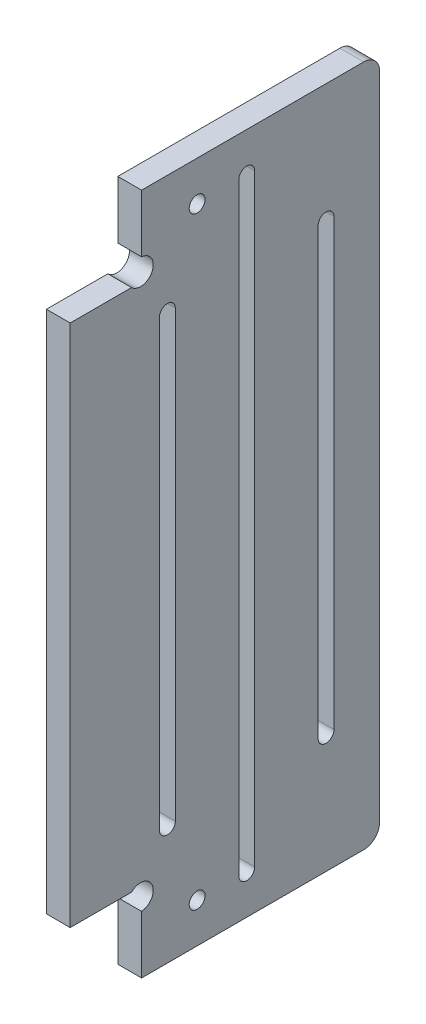
ISO-10303-21;
HEADER;
FILE_DESCRIPTION(('STEP AP214'),'2;1');
FILE_NAME('part.step','',(''),(''),'','','');
FILE_SCHEMA(('AUTOMOTIVE_DESIGN { 1 0 10303 214 1 1 1 1 }'));
ENDSEC;
DATA;
#1=APPLICATION_CONTEXT('core data for automotive mechanical design processes');
#2=APPLICATION_PROTOCOL_DEFINITION('international standard','automotive_design',2000,#1);
#3=PRODUCT_CONTEXT('',#1,'mechanical');
#4=PRODUCT('Part','Part','',(#3));
#5=PRODUCT_RELATED_PRODUCT_CATEGORY('part','',(#4));
#6=PRODUCT_DEFINITION_FORMATION('','',#4);
#7=PRODUCT_DEFINITION_CONTEXT('part definition',#1,'design');
#8=PRODUCT_DEFINITION('design','',#6,#7);
#9=PRODUCT_DEFINITION_SHAPE('','',#8);
#10=(LENGTH_UNIT() NAMED_UNIT(*) SI_UNIT(.MILLI.,.METRE.));
#11=(NAMED_UNIT(*) PLANE_ANGLE_UNIT() SI_UNIT($,.RADIAN.));
#12=(NAMED_UNIT(*) SI_UNIT($,.STERADIAN.) SOLID_ANGLE_UNIT());
#13=UNCERTAINTY_MEASURE_WITH_UNIT(LENGTH_MEASURE(1.E-05),#10,'distance_accuracy_value','');
#14=(GEOMETRIC_REPRESENTATION_CONTEXT(3) GLOBAL_UNCERTAINTY_ASSIGNED_CONTEXT((#13)) GLOBAL_UNIT_ASSIGNED_CONTEXT((#10,
#11,#12)) REPRESENTATION_CONTEXT('',''));
#15=CARTESIAN_POINT('',(0.,0.,0.));
#16=DIRECTION('',(0.,0.,1.));
#17=DIRECTION('',(1.,0.,0.));
#18=AXIS2_PLACEMENT_3D('',#15,#16,#17);
#19=CARTESIAN_POINT('',(3.,219.588795815736,-79.));
#20=DIRECTION('',(0.,0.,-1.));
#21=DIRECTION('',(-1.,0.,0.));
#22=AXIS2_PLACEMENT_3D('',#19,#20,#21);
#23=PLANE('',#22);
#24=DIRECTION('',(0.,-1.,0.));
#25=VECTOR('',#24,1.);
#26=CARTESIAN_POINT('',(0.,219.588795815736,-79.));
#27=LINE('',#26,#25);
#28=CARTESIAN_POINT('',(0.,226.862827305047,-79.));
#29=VERTEX_POINT('',#28);
#30=CARTESIAN_POINT('',(0.,219.588795815736,-79.));
#31=VERTEX_POINT('',#30);
#32=EDGE_CURVE('E240',#29,#31,#27,.T.);
#33=ORIENTED_EDGE('',*,*,#32,.T.);
#34=DIRECTION('',(-1.,0.,0.));
#35=VECTOR('',#34,1.);
#36=CARTESIAN_POINT('',(3.,219.588795815736,-79.));
#37=LINE('',#36,#35);
#38=CARTESIAN_POINT('',(3.,219.588795815736,-79.));
#39=VERTEX_POINT('',#38);
#40=EDGE_CURVE('E370',#39,#31,#37,.T.);
#41=ORIENTED_EDGE('',*,*,#40,.F.);
#42=DIRECTION('',(0.,-1.,0.));
#43=VECTOR('',#42,1.);
#44=CARTESIAN_POINT('',(3.,219.588795815736,-79.));
#45=LINE('',#44,#43);
#46=CARTESIAN_POINT('',(3.,226.862827305047,-79.));
#47=VERTEX_POINT('',#46);
#48=EDGE_CURVE('E308',#47,#39,#45,.T.);
#49=ORIENTED_EDGE('',*,*,#48,.F.);
#50=DIRECTION('',(-1.,0.,0.));
#51=VECTOR('',#50,1.);
#52=CARTESIAN_POINT('',(3.,226.862827305047,-79.));
#53=LINE('',#52,#51);
#54=EDGE_CURVE('E330',#47,#29,#53,.T.);
#55=ORIENTED_EDGE('',*,*,#54,.T.);
#56=EDGE_LOOP('',(#33,#41,#49,#55));
#57=FACE_BOUND('',#56,.T.);
#58=ADVANCED_FACE('F33',(#57),#23,.F.);
#59=CARTESIAN_POINT('',(3.,217.994198154946,-78.8686291501015));
#60=DIRECTION('',(-1.,0.,0.));
#61=DIRECTION('',(0.,0.,1.));
#62=AXIS2_PLACEMENT_3D('',#59,#60,#61);
#63=CYLINDRICAL_SURFACE('',#62,1.6);
#64=CARTESIAN_POINT('',(0.,217.994198154946,-78.8686291501015));
#65=DIRECTION('',(-1.,0.,0.));
#66=DIRECTION('',(0.,0.,1.));
#67=AXIS2_PLACEMENT_3D('',#64,#65,#66);
#68=CIRCLE('',#67,1.6);
#69=CARTESIAN_POINT('',(0.,216.862827305047,-77.737258300203));
#70=VERTEX_POINT('',#69);
#71=EDGE_CURVE('E333',#31,#70,#68,.T.);
#72=ORIENTED_EDGE('',*,*,#71,.T.);
#73=DIRECTION('',(-1.,0.,0.));
#74=VECTOR('',#73,1.);
#75=CARTESIAN_POINT('',(3.,216.862827305047,-77.737258300203));
#76=LINE('',#75,#74);
#77=CARTESIAN_POINT('',(3.,216.862827305047,-77.737258300203));
#78=VERTEX_POINT('',#77);
#79=EDGE_CURVE('E367',#78,#70,#76,.T.);
#80=ORIENTED_EDGE('',*,*,#79,.F.);
#81=CARTESIAN_POINT('',(3.,217.994198154946,-78.8686291501015));
#82=DIRECTION('',(-1.,0.,0.));
#83=DIRECTION('',(0.,0.,1.));
#84=AXIS2_PLACEMENT_3D('',#81,#82,#83);
#85=CIRCLE('',#84,1.6);
#86=EDGE_CURVE('E311',#39,#78,#85,.T.);
#87=ORIENTED_EDGE('',*,*,#86,.F.);
#88=ORIENTED_EDGE('',*,*,#40,.T.);
#89=EDGE_LOOP('',(#72,#80,#87,#88));
#90=FACE_BOUND('',#89,.T.);
#91=ADVANCED_FACE('F433',(#90),#63,.F.);
#92=CARTESIAN_POINT('',(3.,216.862827305047,-77.737258300203));
#93=DIRECTION('',(0.,-1.,0.));
#94=DIRECTION('',(0.,0.,-1.));
#95=AXIS2_PLACEMENT_3D('',#92,#93,#94);
#96=PLANE('',#95);
#97=DIRECTION('',(0.,0.,1.));
#98=VECTOR('',#97,1.);
#99=CARTESIAN_POINT('',(0.,216.862827305047,-77.737258300203));
#100=LINE('',#99,#98);
#101=CARTESIAN_POINT('',(0.,216.862827305047,-70.));
#102=VERTEX_POINT('',#101);
#103=EDGE_CURVE('E335',#70,#102,#100,.T.);
#104=ORIENTED_EDGE('',*,*,#103,.T.);
#105=DIRECTION('',(-1.,0.,0.));
#106=VECTOR('',#105,1.);
#107=CARTESIAN_POINT('',(3.,216.862827305047,-70.));
#108=LINE('',#107,#106);
#109=CARTESIAN_POINT('',(3.,216.862827305047,-70.));
#110=VERTEX_POINT('',#109);
#111=EDGE_CURVE('E364',#110,#102,#108,.T.);
#112=ORIENTED_EDGE('',*,*,#111,.F.);
#113=DIRECTION('',(0.,0.,1.));
#114=VECTOR('',#113,1.);
#115=CARTESIAN_POINT('',(3.,216.862827305047,-77.737258300203));
#116=LINE('',#115,#114);
#117=EDGE_CURVE('E314',#78,#110,#116,.T.);
#118=ORIENTED_EDGE('',*,*,#117,.F.);
#119=ORIENTED_EDGE('',*,*,#79,.T.);
#120=EDGE_LOOP('',(#104,#112,#118,#119));
#121=FACE_BOUND('',#120,.T.);
#122=ADVANCED_FACE('F429',(#121),#96,.F.);
#123=CARTESIAN_POINT('',(3.,150.862827305047,-70.));
#124=DIRECTION('',(0.,0.,-1.));
#125=DIRECTION('',(-1.,0.,0.));
#126=AXIS2_PLACEMENT_3D('',#123,#124,#125);
#127=PLANE('',#126);
#128=DIRECTION('',(0.,-1.,0.));
#129=VECTOR('',#128,1.);
#130=CARTESIAN_POINT('',(0.,150.862827305047,-70.));
#131=LINE('',#130,#129);
#132=CARTESIAN_POINT('',(0.,150.862827305047,-70.));
#133=VERTEX_POINT('',#132);
#134=EDGE_CURVE('E337',#102,#133,#131,.T.);
#135=ORIENTED_EDGE('',*,*,#134,.T.);
#136=DIRECTION('',(-1.,0.,0.));
#137=VECTOR('',#136,1.);
#138=CARTESIAN_POINT('',(3.,150.862827305047,-70.));
#139=LINE('',#138,#137);
#140=CARTESIAN_POINT('',(3.,150.862827305047,-70.));
#141=VERTEX_POINT('',#140);
#142=EDGE_CURVE('E361',#141,#133,#139,.T.);
#143=ORIENTED_EDGE('',*,*,#142,.F.);
#144=DIRECTION('',(0.,-1.,0.));
#145=VECTOR('',#144,1.);
#146=CARTESIAN_POINT('',(3.,150.862827305047,-70.));
#147=LINE('',#146,#145);
#148=EDGE_CURVE('E316',#110,#141,#147,.T.);
#149=ORIENTED_EDGE('',*,*,#148,.F.);
#150=ORIENTED_EDGE('',*,*,#111,.T.);
#151=EDGE_LOOP('',(#135,#143,#149,#150));
#152=FACE_BOUND('',#151,.T.);
#153=ADVANCED_FACE('F425',(#152),#127,.F.);
#154=CARTESIAN_POINT('',(3.,150.862827305047,-77.737258300203));
#155=DIRECTION('',(0.,1.,0.));
#156=DIRECTION('',(0.,0.,1.));
#157=AXIS2_PLACEMENT_3D('',#154,#155,#156);
#158=PLANE('',#157);
#159=DIRECTION('',(0.,0.,-1.));
#160=VECTOR('',#159,1.);
#161=CARTESIAN_POINT('',(0.,150.862827305047,-77.737258300203));
#162=LINE('',#161,#160);
#163=CARTESIAN_POINT('',(0.,150.862827305047,-77.737258300203));
#164=VERTEX_POINT('',#163);
#165=EDGE_CURVE('E339',#133,#164,#162,.T.);
#166=ORIENTED_EDGE('',*,*,#165,.T.);
#167=DIRECTION('',(-1.,0.,0.));
#168=VECTOR('',#167,1.);
#169=CARTESIAN_POINT('',(3.,150.862827305047,-77.737258300203));
#170=LINE('',#169,#168);
#171=CARTESIAN_POINT('',(3.,150.862827305047,-77.737258300203));
#172=VERTEX_POINT('',#171);
#173=EDGE_CURVE('E358',#172,#164,#170,.T.);
#174=ORIENTED_EDGE('',*,*,#173,.F.);
#175=DIRECTION('',(0.,0.,-1.));
#176=VECTOR('',#175,1.);
#177=CARTESIAN_POINT('',(3.,150.862827305047,-77.737258300203));
#178=LINE('',#177,#176);
#179=EDGE_CURVE('E318',#141,#172,#178,.T.);
#180=ORIENTED_EDGE('',*,*,#179,.F.);
#181=ORIENTED_EDGE('',*,*,#142,.T.);
#182=EDGE_LOOP('',(#166,#174,#180,#181));
#183=FACE_BOUND('',#182,.T.);
#184=ADVANCED_FACE('F421',(#183),#158,.F.);
#185=CARTESIAN_POINT('',(3.,149.731456455149,-78.8686291501015));
#186=DIRECTION('',(-1.,0.,0.));
#187=DIRECTION('',(0.,0.,1.));
#188=AXIS2_PLACEMENT_3D('',#185,#186,#187);
#189=CYLINDRICAL_SURFACE('',#188,1.6);
#190=CARTESIAN_POINT('',(0.,149.731456455149,-78.8686291501015));
#191=DIRECTION('',(-1.,0.,0.));
#192=DIRECTION('',(0.,0.,-1.));
#193=AXIS2_PLACEMENT_3D('',#190,#191,#192);
#194=CIRCLE('',#193,1.6);
#195=CARTESIAN_POINT('',(0.,148.136858794359,-79.));
#196=VERTEX_POINT('',#195);
#197=EDGE_CURVE('E341',#164,#196,#194,.T.);
#198=ORIENTED_EDGE('',*,*,#197,.T.);
#199=DIRECTION('',(-1.,0.,0.));
#200=VECTOR('',#199,1.);
#201=CARTESIAN_POINT('',(3.,148.136858794359,-79.));
#202=LINE('',#201,#200);
#203=CARTESIAN_POINT('',(3.,148.136858794359,-79.));
#204=VERTEX_POINT('',#203);
#205=EDGE_CURVE('E355',#204,#196,#202,.T.);
#206=ORIENTED_EDGE('',*,*,#205,.F.);
#207=CARTESIAN_POINT('',(3.,149.731456455149,-78.8686291501015));
#208=DIRECTION('',(-1.,0.,0.));
#209=DIRECTION('',(0.,0.,-1.));
#210=AXIS2_PLACEMENT_3D('',#207,#208,#209);
#211=CIRCLE('',#210,1.6);
#212=EDGE_CURVE('E320',#172,#204,#211,.T.);
#213=ORIENTED_EDGE('',*,*,#212,.F.);
#214=ORIENTED_EDGE('',*,*,#173,.T.);
#215=EDGE_LOOP('',(#198,#206,#213,#214));
#216=FACE_BOUND('',#215,.T.);
#217=ADVANCED_FACE('F416',(#216),#189,.F.);
#218=CARTESIAN_POINT('',(3.,140.862827305047,-79.));
#219=DIRECTION('',(0.,0.,-1.));
#220=DIRECTION('',(0.,1.,0.));
#221=AXIS2_PLACEMENT_3D('',#218,#219,#220);
#222=PLANE('',#221);
#223=DIRECTION('',(0.,-1.,0.));
#224=VECTOR('',#223,1.);
#225=CARTESIAN_POINT('',(0.,140.862827305047,-79.));
#226=LINE('',#225,#224);
#227=CARTESIAN_POINT('',(0.,140.862827305047,-79.));
#228=VERTEX_POINT('',#227);
#229=EDGE_CURVE('E343',#196,#228,#226,.T.);
#230=ORIENTED_EDGE('',*,*,#229,.T.);
#231=DIRECTION('',(-1.,0.,0.));
#232=VECTOR('',#231,1.);
#233=CARTESIAN_POINT('',(3.,140.862827305047,-79.));
#234=LINE('',#233,#232);
#235=CARTESIAN_POINT('',(3.,140.862827305047,-79.));
#236=VERTEX_POINT('',#235);
#237=EDGE_CURVE('E352',#236,#228,#234,.T.);
#238=ORIENTED_EDGE('',*,*,#237,.F.);
#239=DIRECTION('',(0.,-1.,0.));
#240=VECTOR('',#239,1.);
#241=CARTESIAN_POINT('',(3.,140.862827305047,-79.));
#242=LINE('',#241,#240);
#243=EDGE_CURVE('E322',#204,#236,#242,.T.);
#244=ORIENTED_EDGE('',*,*,#243,.F.);
#245=ORIENTED_EDGE('',*,*,#205,.T.);
#246=EDGE_LOOP('',(#230,#238,#244,#245));
#247=FACE_BOUND('',#246,.T.);
#248=ADVANCED_FACE('F410',(#247),#222,.F.);
#249=CARTESIAN_POINT('',(3.,140.862827305047,-79.));
#250=DIRECTION('',(0.,1.,0.));
#251=DIRECTION('',(0.,0.,1.));
#252=AXIS2_PLACEMENT_3D('',#249,#250,#251);
#253=PLANE('',#252);
#254=DIRECTION('',(0.,0.,-1.));
#255=VECTOR('',#254,1.);
#256=CARTESIAN_POINT('',(0.,140.862827305047,-79.));
#257=LINE('',#256,#255);
#258=CARTESIAN_POINT('',(0.,140.862827305047,-107.));
#259=VERTEX_POINT('',#258);
#260=EDGE_CURVE('E345',#228,#259,#257,.T.);
#261=ORIENTED_EDGE('',*,*,#260,.T.);
#262=DIRECTION('',(-1.,0.,0.));
#263=VECTOR('',#262,1.);
#264=CARTESIAN_POINT('',(3.,140.862827305047,-107.));
#265=LINE('',#264,#263);
#266=CARTESIAN_POINT('',(3.,140.862827305047,-107.));
#267=VERTEX_POINT('',#266);
#268=EDGE_CURVE('E11',#259,#267,#265,.F.);
#269=ORIENTED_EDGE('',*,*,#268,.T.);
#270=DIRECTION('',(0.,0.,-1.));
#271=VECTOR('',#270,1.);
#272=CARTESIAN_POINT('',(3.,140.862827305047,-79.));
#273=LINE('',#272,#271);
#274=EDGE_CURVE('E324',#236,#267,#273,.T.);
#275=ORIENTED_EDGE('',*,*,#274,.F.);
#276=ORIENTED_EDGE('',*,*,#237,.T.);
#277=EDGE_LOOP('',(#261,#269,#275,#276));
#278=FACE_BOUND('',#277,.T.);
#279=ADVANCED_FACE('F406',(#278),#253,.F.);
#280=CARTESIAN_POINT('',(3.,140.862827305047,-109.));
#281=DIRECTION('',(0.,0.,1.));
#282=DIRECTION('',(1.,0.,0.));
#283=AXIS2_PLACEMENT_3D('',#280,#281,#282);
#284=PLANE('',#283);
#285=DIRECTION('',(0.,1.,0.));
#286=VECTOR('',#285,1.);
#287=CARTESIAN_POINT('',(0.,140.862827305047,-109.));
#288=LINE('',#287,#286);
#289=CARTESIAN_POINT('',(0.,142.862827305047,-109.));
#290=VERTEX_POINT('',#289);
#291=CARTESIAN_POINT('',(0.,224.862827305047,-109.));
#292=VERTEX_POINT('',#291);
#293=EDGE_CURVE('E347',#290,#292,#288,.T.);
#294=ORIENTED_EDGE('',*,*,#293,.T.);
#295=DIRECTION('',(-1.,0.,0.));
#296=VECTOR('',#295,1.);
#297=CARTESIAN_POINT('',(3.,224.862827305047,-109.));
#298=LINE('',#297,#296);
#299=CARTESIAN_POINT('',(3.,224.862827305047,-109.));
#300=VERTEX_POINT('',#299);
#301=EDGE_CURVE('E54',#292,#300,#298,.F.);
#302=ORIENTED_EDGE('',*,*,#301,.T.);
#303=DIRECTION('',(0.,1.,0.));
#304=VECTOR('',#303,1.);
#305=CARTESIAN_POINT('',(3.,140.862827305047,-109.));
#306=LINE('',#305,#304);
#307=CARTESIAN_POINT('',(3.,142.862827305047,-109.));
#308=VERTEX_POINT('',#307);
#309=EDGE_CURVE('E326',#308,#300,#306,.T.);
#310=ORIENTED_EDGE('',*,*,#309,.F.);
#311=DIRECTION('',(-1.,0.,0.));
#312=VECTOR('',#311,1.);
#313=CARTESIAN_POINT('',(3.,142.862827305047,-109.));
#314=LINE('',#313,#312);
#315=EDGE_CURVE('E380',#308,#290,#314,.T.);
#316=ORIENTED_EDGE('',*,*,#315,.T.);
#317=EDGE_LOOP('',(#294,#302,#310,#316));
#318=FACE_BOUND('',#317,.T.);
#319=ADVANCED_FACE('F400',(#318),#284,.F.);
#320=CARTESIAN_POINT('',(3.,226.862827305047,-109.));
#321=DIRECTION('',(0.,-1.,0.));
#322=DIRECTION('',(0.,0.,-1.));
#323=AXIS2_PLACEMENT_3D('',#320,#321,#322);
#324=PLANE('',#323);
#325=DIRECTION('',(0.,0.,1.));
#326=VECTOR('',#325,1.);
#327=CARTESIAN_POINT('',(3.,226.862827305047,-109.));
#328=LINE('',#327,#326);
#329=CARTESIAN_POINT('',(3.,226.862827305047,-107.));
#330=VERTEX_POINT('',#329);
#331=EDGE_CURVE('E328',#330,#47,#328,.T.);
#332=ORIENTED_EDGE('',*,*,#331,.F.);
#333=DIRECTION('',(-1.,0.,0.));
#334=VECTOR('',#333,1.);
#335=CARTESIAN_POINT('',(3.,226.862827305047,-107.));
#336=LINE('',#335,#334);
#337=CARTESIAN_POINT('',(0.,226.862827305047,-107.));
#338=VERTEX_POINT('',#337);
#339=EDGE_CURVE('E373',#330,#338,#336,.T.);
#340=ORIENTED_EDGE('',*,*,#339,.T.);
#341=DIRECTION('',(0.,0.,1.));
#342=VECTOR('',#341,1.);
#343=CARTESIAN_POINT('',(0.,226.862827305047,-109.));
#344=LINE('',#343,#342);
#345=EDGE_CURVE('E312',#338,#29,#344,.T.);
#346=ORIENTED_EDGE('',*,*,#345,.T.);
#347=ORIENTED_EDGE('',*,*,#54,.F.);
#348=EDGE_LOOP('',(#332,#340,#346,#347));
#349=FACE_BOUND('',#348,.T.);
#350=ADVANCED_FACE('F392',(#349),#324,.F.);
#351=CARTESIAN_POINT('',(3.,149.731456455149,-78.8686291501015));
#352=DIRECTION('',(1.,0.,0.));
#353=DIRECTION('',(0.,0.,-1.));
#354=AXIS2_PLACEMENT_3D('',#351,#352,#353);
#355=PLANE('',#354);
#356=CARTESIAN_POINT('',(3.,221.862827305047,-86.));
#357=DIRECTION('',(-1.,0.,0.));
#358=DIRECTION('',(0.,0.,1.));
#359=AXIS2_PLACEMENT_3D('',#356,#357,#358);
#360=CIRCLE('',#359,0.999999999999998);
#361=CARTESIAN_POINT('',(3.,221.862827305047,-85.));
#362=VERTEX_POINT('',#361);
#363=EDGE_CURVE('E293',#362,#362,#360,.T.);
#364=ORIENTED_EDGE('',*,*,#363,.T.);
#365=EDGE_LOOP('',(#364));
#366=FACE_BOUND('',#365,.T.);
#367=CARTESIAN_POINT('',(3.,145.862827305047,-86.));
#368=DIRECTION('',(-1.,0.,0.));
#369=DIRECTION('',(0.,0.,1.));
#370=AXIS2_PLACEMENT_3D('',#367,#368,#369);
#371=CIRCLE('',#370,0.999999999999998);
#372=CARTESIAN_POINT('',(3.,145.862827305047,-85.));
#373=VERTEX_POINT('',#372);
#374=EDGE_CURVE('E715',#373,#373,#371,.T.);
#375=ORIENTED_EDGE('',*,*,#374,.T.);
#376=EDGE_LOOP('',(#375));
#377=FACE_BOUND('',#376,.T.);
#378=CARTESIAN_POINT('',(3.,155.862827305047,-82.25));
#379=DIRECTION('',(-1.,0.,0.));
#380=DIRECTION('',(0.,0.,1.));
#381=AXIS2_PLACEMENT_3D('',#378,#379,#380);
#382=CIRCLE('',#381,1.);
#383=CARTESIAN_POINT('',(3.,155.862827305047,-83.25));
#384=VERTEX_POINT('',#383);
#385=CARTESIAN_POINT('',(3.,155.862827305047,-81.25));
#386=VERTEX_POINT('',#385);
#387=EDGE_CURVE('E200',#384,#386,#382,.T.);
#388=ORIENTED_EDGE('',*,*,#387,.T.);
#389=DIRECTION('',(0.,1.,0.));
#390=VECTOR('',#389,1.);
#391=CARTESIAN_POINT('',(3.,155.862827305047,-81.25));
#392=LINE('',#391,#390);
#393=CARTESIAN_POINT('',(3.,211.862827305047,-81.25));
#394=VERTEX_POINT('',#393);
#395=EDGE_CURVE('E212',#386,#394,#392,.T.);
#396=ORIENTED_EDGE('',*,*,#395,.T.);
#397=CARTESIAN_POINT('',(3.,211.862827305047,-82.25));
#398=DIRECTION('',(-1.,0.,0.));
#399=DIRECTION('',(0.,0.,1.));
#400=AXIS2_PLACEMENT_3D('',#397,#398,#399);
#401=CIRCLE('',#400,1.00000000000001);
#402=CARTESIAN_POINT('',(3.,211.862827305047,-83.25));
#403=VERTEX_POINT('',#402);
#404=EDGE_CURVE('E216',#394,#403,#401,.T.);
#405=ORIENTED_EDGE('',*,*,#404,.T.);
#406=DIRECTION('',(0.,-1.,0.));
#407=VECTOR('',#406,1.);
#408=CARTESIAN_POINT('',(3.,155.862827305047,-83.25));
#409=LINE('',#408,#407);
#410=EDGE_CURVE('E208',#403,#384,#409,.T.);
#411=ORIENTED_EDGE('',*,*,#410,.T.);
#412=EDGE_LOOP('',(#388,#396,#405,#411));
#413=FACE_BOUND('',#412,.T.);
#414=CARTESIAN_POINT('',(3.,145.862827305047,-92.25));
#415=DIRECTION('',(-1.,0.,0.));
#416=DIRECTION('',(0.,0.,1.));
#417=AXIS2_PLACEMENT_3D('',#414,#415,#416);
#418=CIRCLE('',#417,1.);
#419=CARTESIAN_POINT('',(3.,145.862827305047,-93.25));
#420=VERTEX_POINT('',#419);
#421=CARTESIAN_POINT('',(3.,145.862827305047,-91.25));
#422=VERTEX_POINT('',#421);
#423=EDGE_CURVE('E244',#420,#422,#418,.T.);
#424=ORIENTED_EDGE('',*,*,#423,.T.);
#425=DIRECTION('',(0.,1.,0.));
#426=VECTOR('',#425,1.);
#427=CARTESIAN_POINT('',(3.,145.862827305047,-91.25));
#428=LINE('',#427,#426);
#429=CARTESIAN_POINT('',(3.,221.862827305047,-91.25));
#430=VERTEX_POINT('',#429);
#431=EDGE_CURVE('E247',#422,#430,#428,.T.);
#432=ORIENTED_EDGE('',*,*,#431,.T.);
#433=CARTESIAN_POINT('',(3.,221.862827305047,-92.25));
#434=DIRECTION('',(-1.,0.,0.));
#435=DIRECTION('',(0.,0.,1.));
#436=AXIS2_PLACEMENT_3D('',#433,#434,#435);
#437=CIRCLE('',#436,1.);
#438=CARTESIAN_POINT('',(3.,221.862827305047,-93.25));
#439=VERTEX_POINT('',#438);
#440=EDGE_CURVE('E251',#430,#439,#437,.T.);
#441=ORIENTED_EDGE('',*,*,#440,.T.);
#442=DIRECTION('',(0.,-1.,0.));
#443=VECTOR('',#442,1.);
#444=CARTESIAN_POINT('',(3.,145.862827305047,-93.25));
#445=LINE('',#444,#443);
#446=EDGE_CURVE('E254',#439,#420,#445,.T.);
#447=ORIENTED_EDGE('',*,*,#446,.T.);
#448=EDGE_LOOP('',(#424,#432,#441,#447));
#449=FACE_BOUND('',#448,.T.);
#450=CARTESIAN_POINT('',(3.,155.862827305047,-102.25));
#451=DIRECTION('',(-1.,0.,0.));
#452=DIRECTION('',(0.,0.,1.));
#453=AXIS2_PLACEMENT_3D('',#450,#451,#452);
#454=CIRCLE('',#453,1.);
#455=CARTESIAN_POINT('',(3.,155.862827305047,-103.25));
#456=VERTEX_POINT('',#455);
#457=CARTESIAN_POINT('',(3.,155.862827305047,-101.25));
#458=VERTEX_POINT('',#457);
#459=EDGE_CURVE('E276',#456,#458,#454,.T.);
#460=ORIENTED_EDGE('',*,*,#459,.T.);
#461=DIRECTION('',(0.,1.,0.));
#462=VECTOR('',#461,1.);
#463=CARTESIAN_POINT('',(3.,155.862827305047,-101.25));
#464=LINE('',#463,#462);
#465=CARTESIAN_POINT('',(3.,211.862827305047,-101.25));
#466=VERTEX_POINT('',#465);
#467=EDGE_CURVE('E279',#458,#466,#464,.T.);
#468=ORIENTED_EDGE('',*,*,#467,.T.);
#469=CARTESIAN_POINT('',(3.,211.862827305047,-102.25));
#470=DIRECTION('',(-1.,0.,0.));
#471=DIRECTION('',(0.,0.,1.));
#472=AXIS2_PLACEMENT_3D('',#469,#470,#471);
#473=CIRCLE('',#472,1.);
#474=CARTESIAN_POINT('',(3.,211.862827305047,-103.25));
#475=VERTEX_POINT('',#474);
#476=EDGE_CURVE('E283',#466,#475,#473,.T.);
#477=ORIENTED_EDGE('',*,*,#476,.T.);
#478=DIRECTION('',(0.,-1.,0.));
#479=VECTOR('',#478,1.);
#480=CARTESIAN_POINT('',(3.,155.862827305047,-103.25));
#481=LINE('',#480,#479);
#482=EDGE_CURVE('E286',#475,#456,#481,.T.);
#483=ORIENTED_EDGE('',*,*,#482,.T.);
#484=EDGE_LOOP('',(#460,#468,#477,#483));
#485=FACE_BOUND('',#484,.T.);
#486=ORIENTED_EDGE('',*,*,#309,.T.);
#487=CARTESIAN_POINT('',(3.,224.862827305047,-107.));
#488=DIRECTION('',(1.,0.,0.));
#489=DIRECTION('',(0.,0.,-1.));
#490=AXIS2_PLACEMENT_3D('',#487,#488,#489);
#491=CIRCLE('',#490,2.);
#492=EDGE_CURVE('E41',#300,#330,#491,.T.);
#493=ORIENTED_EDGE('',*,*,#492,.T.);
#494=ORIENTED_EDGE('',*,*,#331,.T.);
#495=ORIENTED_EDGE('',*,*,#48,.T.);
#496=ORIENTED_EDGE('',*,*,#86,.T.);
#497=ORIENTED_EDGE('',*,*,#117,.T.);
#498=ORIENTED_EDGE('',*,*,#148,.T.);
#499=ORIENTED_EDGE('',*,*,#179,.T.);
#500=ORIENTED_EDGE('',*,*,#212,.T.);
#501=ORIENTED_EDGE('',*,*,#243,.T.);
#502=ORIENTED_EDGE('',*,*,#274,.T.);
#503=CARTESIAN_POINT('',(3.,142.862827305047,-107.));
#504=DIRECTION('',(1.,0.,0.));
#505=DIRECTION('',(0.,0.,-1.));
#506=AXIS2_PLACEMENT_3D('',#503,#504,#505);
#507=CIRCLE('',#506,2.);
#508=EDGE_CURVE('E384',#267,#308,#507,.T.);
#509=ORIENTED_EDGE('',*,*,#508,.T.);
#510=EDGE_LOOP('',(#486,#493,#494,#495,#496,#497,#498,#499,#500,#501,#502,#509));
#511=FACE_BOUND('',#510,.T.);
#512=ADVANCED_FACE('F218',(#366,#377,#413,#449,#485,#511),#355,.T.);
#513=CARTESIAN_POINT('',(0.,149.731456455149,-78.8686291501015));
#514=DIRECTION('',(1.,0.,0.));
#515=DIRECTION('',(0.,0.,-1.));
#516=AXIS2_PLACEMENT_3D('',#513,#514,#515);
#517=PLANE('',#516);
#518=CARTESIAN_POINT('',(0.,221.862827305047,-86.));
#519=DIRECTION('',(-1.,0.,0.));
#520=DIRECTION('',(0.,0.,1.));
#521=AXIS2_PLACEMENT_3D('',#518,#519,#520);
#522=CIRCLE('',#521,0.999999999999998);
#523=CARTESIAN_POINT('',(0.,221.862827305047,-85.));
#524=VERTEX_POINT('',#523);
#525=EDGE_CURVE('E689',#524,#524,#522,.T.);
#526=ORIENTED_EDGE('',*,*,#525,.F.);
#527=EDGE_LOOP('',(#526));
#528=FACE_BOUND('',#527,.T.);
#529=CARTESIAN_POINT('',(0.,145.862827305047,-86.));
#530=DIRECTION('',(-1.,0.,0.));
#531=DIRECTION('',(0.,0.,1.));
#532=AXIS2_PLACEMENT_3D('',#529,#530,#531);
#533=CIRCLE('',#532,0.999999999999998);
#534=CARTESIAN_POINT('',(0.,145.862827305047,-85.));
#535=VERTEX_POINT('',#534);
#536=EDGE_CURVE('E227',#535,#535,#533,.T.);
#537=ORIENTED_EDGE('',*,*,#536,.F.);
#538=EDGE_LOOP('',(#537));
#539=FACE_BOUND('',#538,.T.);
#540=DIRECTION('',(0.,1.,0.));
#541=VECTOR('',#540,1.);
#542=CARTESIAN_POINT('',(0.,155.862827305047,-81.25));
#543=LINE('',#542,#541);
#544=CARTESIAN_POINT('',(0.,155.862827305047,-81.25));
#545=VERTEX_POINT('',#544);
#546=CARTESIAN_POINT('',(0.,211.862827305047,-81.25));
#547=VERTEX_POINT('',#546);
#548=EDGE_CURVE('E233',#545,#547,#543,.T.);
#549=ORIENTED_EDGE('',*,*,#548,.F.);
#550=CARTESIAN_POINT('',(0.,155.862827305047,-82.25));
#551=DIRECTION('',(-1.,0.,0.));
#552=DIRECTION('',(0.,0.,1.));
#553=AXIS2_PLACEMENT_3D('',#550,#551,#552);
#554=CIRCLE('',#553,1.);
#555=CARTESIAN_POINT('',(0.,155.862827305047,-83.25));
#556=VERTEX_POINT('',#555);
#557=EDGE_CURVE('E203',#556,#545,#554,.T.);
#558=ORIENTED_EDGE('',*,*,#557,.F.);
#559=DIRECTION('',(0.,-1.,0.));
#560=VECTOR('',#559,1.);
#561=CARTESIAN_POINT('',(0.,155.862827305047,-83.25));
#562=LINE('',#561,#560);
#563=CARTESIAN_POINT('',(0.,211.862827305047,-83.25));
#564=VERTEX_POINT('',#563);
#565=EDGE_CURVE('E221',#564,#556,#562,.T.);
#566=ORIENTED_EDGE('',*,*,#565,.F.);
#567=CARTESIAN_POINT('',(0.,211.862827305047,-82.25));
#568=DIRECTION('',(-1.,0.,0.));
#569=DIRECTION('',(0.,0.,1.));
#570=AXIS2_PLACEMENT_3D('',#567,#568,#569);
#571=CIRCLE('',#570,1.00000000000001);
#572=EDGE_CURVE('E224',#547,#564,#571,.T.);
#573=ORIENTED_EDGE('',*,*,#572,.F.);
#574=EDGE_LOOP('',(#549,#558,#566,#573));
#575=FACE_BOUND('',#574,.T.);
#576=DIRECTION('',(0.,1.,0.));
#577=VECTOR('',#576,1.);
#578=CARTESIAN_POINT('',(0.,145.862827305047,-91.25));
#579=LINE('',#578,#577);
#580=CARTESIAN_POINT('',(0.,145.862827305047,-91.25));
#581=VERTEX_POINT('',#580);
#582=CARTESIAN_POINT('',(0.,221.862827305047,-91.25));
#583=VERTEX_POINT('',#582);
#584=EDGE_CURVE('E260',#581,#583,#579,.T.);
#585=ORIENTED_EDGE('',*,*,#584,.F.);
#586=CARTESIAN_POINT('',(0.,145.862827305047,-92.25));
#587=DIRECTION('',(-1.,0.,0.));
#588=DIRECTION('',(0.,0.,1.));
#589=AXIS2_PLACEMENT_3D('',#586,#587,#588);
#590=CIRCLE('',#589,1.);
#591=CARTESIAN_POINT('',(0.,145.862827305047,-93.25));
#592=VERTEX_POINT('',#591);
#593=EDGE_CURVE('E258',#592,#581,#590,.T.);
#594=ORIENTED_EDGE('',*,*,#593,.F.);
#595=DIRECTION('',(0.,-1.,0.));
#596=VECTOR('',#595,1.);
#597=CARTESIAN_POINT('',(0.,145.862827305047,-93.25));
#598=LINE('',#597,#596);
#599=CARTESIAN_POINT('',(0.,221.862827305047,-93.25));
#600=VERTEX_POINT('',#599);
#601=EDGE_CURVE('E248',#600,#592,#598,.T.);
#602=ORIENTED_EDGE('',*,*,#601,.F.);
#603=CARTESIAN_POINT('',(0.,221.862827305047,-92.25));
#604=DIRECTION('',(-1.,0.,0.));
#605=DIRECTION('',(0.,0.,1.));
#606=AXIS2_PLACEMENT_3D('',#603,#604,#605);
#607=CIRCLE('',#606,1.);
#608=EDGE_CURVE('E264',#583,#600,#607,.T.);
#609=ORIENTED_EDGE('',*,*,#608,.F.);
#610=EDGE_LOOP('',(#585,#594,#602,#609));
#611=FACE_BOUND('',#610,.T.);
#612=DIRECTION('',(0.,1.,0.));
#613=VECTOR('',#612,1.);
#614=CARTESIAN_POINT('',(0.,155.862827305047,-101.25));
#615=LINE('',#614,#613);
#616=CARTESIAN_POINT('',(0.,155.862827305047,-101.25));
#617=VERTEX_POINT('',#616);
#618=CARTESIAN_POINT('',(0.,211.862827305047,-101.25));
#619=VERTEX_POINT('',#618);
#620=EDGE_CURVE('E292',#617,#619,#615,.T.);
#621=ORIENTED_EDGE('',*,*,#620,.F.);
#622=CARTESIAN_POINT('',(0.,155.862827305047,-102.25));
#623=DIRECTION('',(-1.,0.,0.));
#624=DIRECTION('',(0.,0.,1.));
#625=AXIS2_PLACEMENT_3D('',#622,#623,#624);
#626=CIRCLE('',#625,1.);
#627=CARTESIAN_POINT('',(0.,155.862827305047,-103.25));
#628=VERTEX_POINT('',#627);
#629=EDGE_CURVE('E290',#628,#617,#626,.T.);
#630=ORIENTED_EDGE('',*,*,#629,.F.);
#631=DIRECTION('',(0.,-1.,0.));
#632=VECTOR('',#631,1.);
#633=CARTESIAN_POINT('',(0.,155.862827305047,-103.25));
#634=LINE('',#633,#632);
#635=CARTESIAN_POINT('',(0.,211.862827305047,-103.25));
#636=VERTEX_POINT('',#635);
#637=EDGE_CURVE('E280',#636,#628,#634,.T.);
#638=ORIENTED_EDGE('',*,*,#637,.F.);
#639=CARTESIAN_POINT('',(0.,211.862827305047,-102.25));
#640=DIRECTION('',(-1.,0.,0.));
#641=DIRECTION('',(0.,0.,1.));
#642=AXIS2_PLACEMENT_3D('',#639,#640,#641);
#643=CIRCLE('',#642,1.);
#644=EDGE_CURVE('E296',#619,#636,#643,.T.);
#645=ORIENTED_EDGE('',*,*,#644,.F.);
#646=EDGE_LOOP('',(#621,#630,#638,#645));
#647=FACE_BOUND('',#646,.T.);
#648=ORIENTED_EDGE('',*,*,#345,.F.);
#649=CARTESIAN_POINT('',(0.,224.862827305047,-107.));
#650=DIRECTION('',(1.,0.,0.));
#651=DIRECTION('',(0.,0.,-1.));
#652=AXIS2_PLACEMENT_3D('',#649,#650,#651);
#653=CIRCLE('',#652,2.);
#654=EDGE_CURVE('E378',#338,#292,#653,.F.);
#655=ORIENTED_EDGE('',*,*,#654,.T.);
#656=ORIENTED_EDGE('',*,*,#293,.F.);
#657=CARTESIAN_POINT('',(0.,142.862827305047,-107.));
#658=DIRECTION('',(1.,0.,0.));
#659=DIRECTION('',(0.,0.,-1.));
#660=AXIS2_PLACEMENT_3D('',#657,#658,#659);
#661=CIRCLE('',#660,2.);
#662=EDGE_CURVE('E376',#290,#259,#661,.F.);
#663=ORIENTED_EDGE('',*,*,#662,.T.);
#664=ORIENTED_EDGE('',*,*,#260,.F.);
#665=ORIENTED_EDGE('',*,*,#229,.F.);
#666=ORIENTED_EDGE('',*,*,#197,.F.);
#667=ORIENTED_EDGE('',*,*,#165,.F.);
#668=ORIENTED_EDGE('',*,*,#134,.F.);
#669=ORIENTED_EDGE('',*,*,#103,.F.);
#670=ORIENTED_EDGE('',*,*,#71,.F.);
#671=ORIENTED_EDGE('',*,*,#32,.F.);
#672=EDGE_LOOP('',(#648,#655,#656,#663,#664,#665,#666,#667,#668,#669,#670,#671));
#673=FACE_BOUND('',#672,.T.);
#674=ADVANCED_FACE('F398',(#528,#539,#575,#611,#647,#673),#517,.F.);
#675=CARTESIAN_POINT('',(3.,155.862827305047,-102.25));
#676=DIRECTION('',(-1.,0.,0.));
#677=DIRECTION('',(0.,0.,1.));
#678=AXIS2_PLACEMENT_3D('',#675,#676,#677);
#679=CYLINDRICAL_SURFACE('',#678,1.);
#680=ORIENTED_EDGE('',*,*,#629,.T.);
#681=DIRECTION('',(-1.,0.,0.));
#682=VECTOR('',#681,1.);
#683=CARTESIAN_POINT('',(3.,155.862827305047,-101.25));
#684=LINE('',#683,#682);
#685=EDGE_CURVE('E289',#458,#617,#684,.T.);
#686=ORIENTED_EDGE('',*,*,#685,.F.);
#687=ORIENTED_EDGE('',*,*,#459,.F.);
#688=DIRECTION('',(-1.,0.,0.));
#689=VECTOR('',#688,1.);
#690=CARTESIAN_POINT('',(3.,155.862827305047,-103.25));
#691=LINE('',#690,#689);
#692=EDGE_CURVE('E261',#456,#628,#691,.T.);
#693=ORIENTED_EDGE('',*,*,#692,.T.);
#694=EDGE_LOOP('',(#680,#686,#687,#693));
#695=FACE_BOUND('',#694,.T.);
#696=ADVANCED_FACE('F493',(#695),#679,.F.);
#697=CARTESIAN_POINT('',(3.,155.862827305047,-103.25));
#698=DIRECTION('',(0.,0.,-1.));
#699=DIRECTION('',(-1.,0.,0.));
#700=AXIS2_PLACEMENT_3D('',#697,#698,#699);
#701=PLANE('',#700);
#702=ORIENTED_EDGE('',*,*,#637,.T.);
#703=ORIENTED_EDGE('',*,*,#692,.F.);
#704=ORIENTED_EDGE('',*,*,#482,.F.);
#705=DIRECTION('',(-1.,0.,0.));
#706=VECTOR('',#705,1.);
#707=CARTESIAN_POINT('',(3.,211.862827305047,-103.25));
#708=LINE('',#707,#706);
#709=EDGE_CURVE('E302',#475,#636,#708,.T.);
#710=ORIENTED_EDGE('',*,*,#709,.T.);
#711=EDGE_LOOP('',(#702,#703,#704,#710));
#712=FACE_BOUND('',#711,.T.);
#713=ADVANCED_FACE('F489',(#712),#701,.F.);
#714=CARTESIAN_POINT('',(3.,211.862827305047,-102.25));
#715=DIRECTION('',(-1.,0.,0.));
#716=DIRECTION('',(0.,0.,1.));
#717=AXIS2_PLACEMENT_3D('',#714,#715,#716);
#718=CYLINDRICAL_SURFACE('',#717,1.);
#719=ORIENTED_EDGE('',*,*,#644,.T.);
#720=ORIENTED_EDGE('',*,*,#709,.F.);
#721=ORIENTED_EDGE('',*,*,#476,.F.);
#722=DIRECTION('',(-1.,0.,0.));
#723=VECTOR('',#722,1.);
#724=CARTESIAN_POINT('',(3.,211.862827305047,-101.25));
#725=LINE('',#724,#723);
#726=EDGE_CURVE('E304',#466,#619,#725,.T.);
#727=ORIENTED_EDGE('',*,*,#726,.T.);
#728=EDGE_LOOP('',(#719,#720,#721,#727));
#729=FACE_BOUND('',#728,.T.);
#730=ADVANCED_FACE('F492',(#729),#718,.F.);
#731=CARTESIAN_POINT('',(3.,155.862827305047,-101.25));
#732=DIRECTION('',(0.,0.,1.));
#733=DIRECTION('',(1.,0.,0.));
#734=AXIS2_PLACEMENT_3D('',#731,#732,#733);
#735=PLANE('',#734);
#736=ORIENTED_EDGE('',*,*,#620,.T.);
#737=ORIENTED_EDGE('',*,*,#726,.F.);
#738=ORIENTED_EDGE('',*,*,#467,.F.);
#739=ORIENTED_EDGE('',*,*,#685,.T.);
#740=EDGE_LOOP('',(#736,#737,#738,#739));
#741=FACE_BOUND('',#740,.T.);
#742=ADVANCED_FACE('F487',(#741),#735,.F.);
#743=CARTESIAN_POINT('',(3.,145.862827305047,-92.25));
#744=DIRECTION('',(-1.,0.,0.));
#745=DIRECTION('',(0.,0.,1.));
#746=AXIS2_PLACEMENT_3D('',#743,#744,#745);
#747=CYLINDRICAL_SURFACE('',#746,1.);
#748=ORIENTED_EDGE('',*,*,#593,.T.);
#749=DIRECTION('',(-1.,0.,0.));
#750=VECTOR('',#749,1.);
#751=CARTESIAN_POINT('',(3.,145.862827305047,-91.25));
#752=LINE('',#751,#750);
#753=EDGE_CURVE('E257',#422,#581,#752,.T.);
#754=ORIENTED_EDGE('',*,*,#753,.F.);
#755=ORIENTED_EDGE('',*,*,#423,.F.);
#756=DIRECTION('',(-1.,0.,0.));
#757=VECTOR('',#756,1.);
#758=CARTESIAN_POINT('',(3.,145.862827305047,-93.25));
#759=LINE('',#758,#757);
#760=EDGE_CURVE('E234',#420,#592,#759,.T.);
#761=ORIENTED_EDGE('',*,*,#760,.T.);
#762=EDGE_LOOP('',(#748,#754,#755,#761));
#763=FACE_BOUND('',#762,.T.);
#764=ADVANCED_FACE('F477',(#763),#747,.F.);
#765=CARTESIAN_POINT('',(3.,145.862827305047,-93.25));
#766=DIRECTION('',(0.,0.,-1.));
#767=DIRECTION('',(-1.,0.,0.));
#768=AXIS2_PLACEMENT_3D('',#765,#766,#767);
#769=PLANE('',#768);
#770=ORIENTED_EDGE('',*,*,#601,.T.);
#771=ORIENTED_EDGE('',*,*,#760,.F.);
#772=ORIENTED_EDGE('',*,*,#446,.F.);
#773=DIRECTION('',(-1.,0.,0.));
#774=VECTOR('',#773,1.);
#775=CARTESIAN_POINT('',(3.,221.862827305047,-93.25));
#776=LINE('',#775,#774);
#777=EDGE_CURVE('E270',#439,#600,#776,.T.);
#778=ORIENTED_EDGE('',*,*,#777,.T.);
#779=EDGE_LOOP('',(#770,#771,#772,#778));
#780=FACE_BOUND('',#779,.T.);
#781=ADVANCED_FACE('F473',(#780),#769,.F.);
#782=CARTESIAN_POINT('',(3.,221.862827305047,-92.25));
#783=DIRECTION('',(-1.,0.,0.));
#784=DIRECTION('',(0.,0.,1.));
#785=AXIS2_PLACEMENT_3D('',#782,#783,#784);
#786=CYLINDRICAL_SURFACE('',#785,1.);
#787=ORIENTED_EDGE('',*,*,#608,.T.);
#788=ORIENTED_EDGE('',*,*,#777,.F.);
#789=ORIENTED_EDGE('',*,*,#440,.F.);
#790=DIRECTION('',(-1.,0.,0.));
#791=VECTOR('',#790,1.);
#792=CARTESIAN_POINT('',(3.,221.862827305047,-91.25));
#793=LINE('',#792,#791);
#794=EDGE_CURVE('E272',#430,#583,#793,.T.);
#795=ORIENTED_EDGE('',*,*,#794,.T.);
#796=EDGE_LOOP('',(#787,#788,#789,#795));
#797=FACE_BOUND('',#796,.T.);
#798=ADVANCED_FACE('F476',(#797),#786,.F.);
#799=CARTESIAN_POINT('',(3.,145.862827305047,-91.25));
#800=DIRECTION('',(0.,0.,1.));
#801=DIRECTION('',(1.,0.,0.));
#802=AXIS2_PLACEMENT_3D('',#799,#800,#801);
#803=PLANE('',#802);
#804=ORIENTED_EDGE('',*,*,#584,.T.);
#805=ORIENTED_EDGE('',*,*,#794,.F.);
#806=ORIENTED_EDGE('',*,*,#431,.F.);
#807=ORIENTED_EDGE('',*,*,#753,.T.);
#808=EDGE_LOOP('',(#804,#805,#806,#807));
#809=FACE_BOUND('',#808,.T.);
#810=ADVANCED_FACE('F472',(#809),#803,.F.);
#811=CARTESIAN_POINT('',(3.,155.862827305047,-82.25));
#812=DIRECTION('',(-1.,0.,0.));
#813=DIRECTION('',(0.,0.,1.));
#814=AXIS2_PLACEMENT_3D('',#811,#812,#813);
#815=CYLINDRICAL_SURFACE('',#814,1.);
#816=ORIENTED_EDGE('',*,*,#557,.T.);
#817=DIRECTION('',(-1.,0.,0.));
#818=VECTOR('',#817,1.);
#819=CARTESIAN_POINT('',(3.,155.862827305047,-81.25));
#820=LINE('',#819,#818);
#821=EDGE_CURVE('E196',#386,#545,#820,.T.);
#822=ORIENTED_EDGE('',*,*,#821,.F.);
#823=ORIENTED_EDGE('',*,*,#387,.F.);
#824=DIRECTION('',(-1.,0.,0.));
#825=VECTOR('',#824,1.);
#826=CARTESIAN_POINT('',(3.,155.862827305047,-83.25));
#827=LINE('',#826,#825);
#828=EDGE_CURVE('E238',#384,#556,#827,.T.);
#829=ORIENTED_EDGE('',*,*,#828,.T.);
#830=EDGE_LOOP('',(#816,#822,#823,#829));
#831=FACE_BOUND('',#830,.T.);
#832=ADVANCED_FACE('F198',(#831),#815,.F.);
#833=CARTESIAN_POINT('',(3.,155.862827305047,-83.25));
#834=DIRECTION('',(0.,0.,-1.));
#835=DIRECTION('',(0.,1.,0.));
#836=AXIS2_PLACEMENT_3D('',#833,#834,#835);
#837=PLANE('',#836);
#838=ORIENTED_EDGE('',*,*,#565,.T.);
#839=ORIENTED_EDGE('',*,*,#828,.F.);
#840=ORIENTED_EDGE('',*,*,#410,.F.);
#841=DIRECTION('',(-1.,0.,0.));
#842=VECTOR('',#841,1.);
#843=CARTESIAN_POINT('',(3.,211.862827305047,-83.25));
#844=LINE('',#843,#842);
#845=EDGE_CURVE('E241',#403,#564,#844,.T.);
#846=ORIENTED_EDGE('',*,*,#845,.T.);
#847=EDGE_LOOP('',(#838,#839,#840,#846));
#848=FACE_BOUND('',#847,.T.);
#849=ADVANCED_FACE('F460',(#848),#837,.F.);
#850=CARTESIAN_POINT('',(3.,211.862827305047,-82.25));
#851=DIRECTION('',(-1.,0.,0.));
#852=DIRECTION('',(0.,0.,1.));
#853=AXIS2_PLACEMENT_3D('',#850,#851,#852);
#854=CYLINDRICAL_SURFACE('',#853,1.00000000000001);
#855=ORIENTED_EDGE('',*,*,#572,.T.);
#856=ORIENTED_EDGE('',*,*,#845,.F.);
#857=ORIENTED_EDGE('',*,*,#404,.F.);
#858=DIRECTION('',(-1.,0.,0.));
#859=VECTOR('',#858,1.);
#860=CARTESIAN_POINT('',(3.,211.862827305047,-81.25));
#861=LINE('',#860,#859);
#862=EDGE_CURVE('E207',#394,#547,#861,.T.);
#863=ORIENTED_EDGE('',*,*,#862,.T.);
#864=EDGE_LOOP('',(#855,#856,#857,#863));
#865=FACE_BOUND('',#864,.T.);
#866=ADVANCED_FACE('F463',(#865),#854,.F.);
#867=CARTESIAN_POINT('',(3.,155.862827305047,-81.25));
#868=DIRECTION('',(0.,0.,1.));
#869=DIRECTION('',(0.,-1.,0.));
#870=AXIS2_PLACEMENT_3D('',#867,#868,#869);
#871=PLANE('',#870);
#872=ORIENTED_EDGE('',*,*,#548,.T.);
#873=ORIENTED_EDGE('',*,*,#862,.F.);
#874=ORIENTED_EDGE('',*,*,#395,.F.);
#875=ORIENTED_EDGE('',*,*,#821,.T.);
#876=EDGE_LOOP('',(#872,#873,#874,#875));
#877=FACE_BOUND('',#876,.T.);
#878=ADVANCED_FACE('F213',(#877),#871,.F.);
#879=CARTESIAN_POINT('',(3.,145.862827305047,-86.));
#880=DIRECTION('',(-1.,0.,0.));
#881=DIRECTION('',(0.,0.,1.));
#882=AXIS2_PLACEMENT_3D('',#879,#880,#881);
#883=CYLINDRICAL_SURFACE('',#882,0.999999999999998);
#884=ORIENTED_EDGE('',*,*,#374,.F.);
#885=EDGE_LOOP('',(#884));
#886=FACE_BOUND('',#885,.T.);
#887=ORIENTED_EDGE('',*,*,#536,.T.);
#888=EDGE_LOOP('',(#887));
#889=FACE_BOUND('',#888,.T.);
#890=ADVANCED_FACE('F449',(#886,#889),#883,.F.);
#891=CARTESIAN_POINT('',(3.,221.862827305047,-86.));
#892=DIRECTION('',(-1.,0.,0.));
#893=DIRECTION('',(0.,0.,1.));
#894=AXIS2_PLACEMENT_3D('',#891,#892,#893);
#895=CYLINDRICAL_SURFACE('',#894,0.999999999999998);
#896=ORIENTED_EDGE('',*,*,#363,.F.);
#897=EDGE_LOOP('',(#896));
#898=FACE_BOUND('',#897,.T.);
#899=ORIENTED_EDGE('',*,*,#525,.T.);
#900=EDGE_LOOP('',(#899));
#901=FACE_BOUND('',#900,.T.);
#902=ADVANCED_FACE('F444',(#898,#901),#895,.F.);
#903=CARTESIAN_POINT('',(3.,224.862827305047,-107.));
#904=DIRECTION('',(-1.,0.,0.));
#905=DIRECTION('',(0.,0.,1.));
#906=AXIS2_PLACEMENT_3D('',#903,#904,#905);
#907=CYLINDRICAL_SURFACE('',#906,2.);
#908=ORIENTED_EDGE('',*,*,#492,.F.);
#909=ORIENTED_EDGE('',*,*,#301,.F.);
#910=ORIENTED_EDGE('',*,*,#654,.F.);
#911=ORIENTED_EDGE('',*,*,#339,.F.);
#912=EDGE_LOOP('',(#908,#909,#910,#911));
#913=FACE_BOUND('',#912,.T.);
#914=ADVANCED_FACE('F395',(#913),#907,.T.);
#915=CARTESIAN_POINT('',(3.,142.862827305047,-107.));
#916=DIRECTION('',(-1.,0.,0.));
#917=DIRECTION('',(0.,0.,1.));
#918=AXIS2_PLACEMENT_3D('',#915,#916,#917);
#919=CYLINDRICAL_SURFACE('',#918,2.);
#920=ORIENTED_EDGE('',*,*,#508,.F.);
#921=ORIENTED_EDGE('',*,*,#268,.F.);
#922=ORIENTED_EDGE('',*,*,#662,.F.);
#923=ORIENTED_EDGE('',*,*,#315,.F.);
#924=EDGE_LOOP('',(#920,#921,#922,#923));
#925=FACE_BOUND('',#924,.T.);
#926=ADVANCED_FACE('F35',(#925),#919,.T.);
#927=CLOSED_SHELL('',(#58,#91,#122,#153,#184,#217,#248,#279,#319,#350,#512,#674,#696,#713,#730,
#742,#764,#781,#798,#810,#832,#849,#866,#878,#890,#902,#914,#926));
#928=MANIFOLD_SOLID_BREP('B2',#927);
#929=ADVANCED_BREP_SHAPE_REPRESENTATION('',(#18,#928),#14);
#930=SHAPE_DEFINITION_REPRESENTATION(#9,#929);
ENDSEC;
END-ISO-10303-21;
